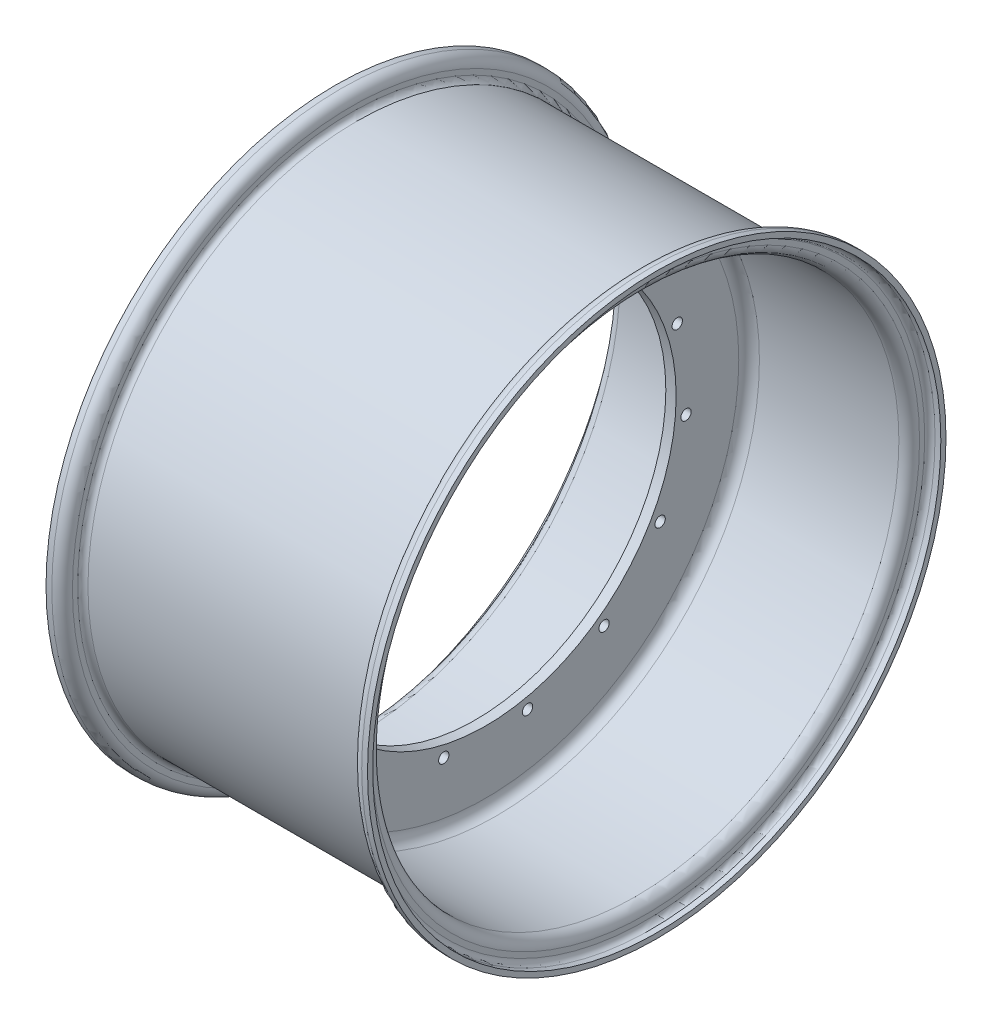
ISO-10303-21;
HEADER;
FILE_DESCRIPTION(('STEP AP214'),'2;1');
FILE_NAME('part.step','',(''),(''),'','','');
FILE_SCHEMA(('AUTOMOTIVE_DESIGN { 1 0 10303 214 1 1 1 1 }'));
ENDSEC;
DATA;
#1=APPLICATION_CONTEXT('core data for automotive mechanical design processes');
#2=APPLICATION_PROTOCOL_DEFINITION('international standard','automotive_design',2000,#1);
#3=PRODUCT_CONTEXT('',#1,'mechanical');
#4=PRODUCT('Part','Part','',(#3));
#5=PRODUCT_RELATED_PRODUCT_CATEGORY('part','',(#4));
#6=PRODUCT_DEFINITION_FORMATION('','',#4);
#7=PRODUCT_DEFINITION_CONTEXT('part definition',#1,'design');
#8=PRODUCT_DEFINITION('design','',#6,#7);
#9=PRODUCT_DEFINITION_SHAPE('','',#8);
#10=(LENGTH_UNIT() NAMED_UNIT(*) SI_UNIT(.MILLI.,.METRE.));
#11=(NAMED_UNIT(*) PLANE_ANGLE_UNIT() SI_UNIT($,.RADIAN.));
#12=(NAMED_UNIT(*) SI_UNIT($,.STERADIAN.) SOLID_ANGLE_UNIT());
#13=UNCERTAINTY_MEASURE_WITH_UNIT(LENGTH_MEASURE(1.E-05),#10,'distance_accuracy_value','');
#14=(GEOMETRIC_REPRESENTATION_CONTEXT(3) GLOBAL_UNCERTAINTY_ASSIGNED_CONTEXT((#13)) GLOBAL_UNIT_ASSIGNED_CONTEXT((#10,
#11,#12)) REPRESENTATION_CONTEXT('',''));
#15=CARTESIAN_POINT('',(0.,0.,0.));
#16=DIRECTION('',(0.,0.,1.));
#17=DIRECTION('',(1.,0.,0.));
#18=AXIS2_PLACEMENT_3D('',#15,#16,#17);
#19=CARTESIAN_POINT('',(104.775,0.,0.));
#20=DIRECTION('',(-1.,0.,0.));
#21=DIRECTION('',(0.,0.,-1.));
#22=AXIS2_PLACEMENT_3D('',#19,#20,#21);
#23=TOROIDAL_SURFACE('',#22,171.45,3.17499999999999);
#24=CARTESIAN_POINT('',(104.775,0.,0.));
#25=DIRECTION('',(1.,0.,0.));
#26=DIRECTION('',(0.,0.,-1.));
#27=AXIS2_PLACEMENT_3D('',#24,#25,#26);
#28=CIRCLE('',#27,174.625);
#29=CARTESIAN_POINT('',(104.775,0.,-174.625));
#30=VERTEX_POINT('',#29);
#31=EDGE_CURVE('E113',#30,#30,#28,.T.);
#32=ORIENTED_EDGE('',*,*,#31,.T.);
#33=EDGE_LOOP('',(#32));
#34=FACE_BOUND('',#33,.T.);
#35=CARTESIAN_POINT('',(101.6,0.,0.));
#36=DIRECTION('',(1.,0.,0.));
#37=DIRECTION('',(0.,0.,-1.));
#38=AXIS2_PLACEMENT_3D('',#35,#36,#37);
#39=CIRCLE('',#38,171.45);
#40=CARTESIAN_POINT('',(101.6,0.,-171.45));
#41=VERTEX_POINT('',#40);
#42=EDGE_CURVE('E50',#41,#41,#39,.T.);
#43=ORIENTED_EDGE('',*,*,#42,.F.);
#44=EDGE_LOOP('',(#43));
#45=FACE_BOUND('',#44,.T.);
#46=ADVANCED_FACE('F30',(#34,#45),#23,.F.);
#47=CARTESIAN_POINT('',(101.6,168.275,0.));
#48=DIRECTION('',(-1.,0.,0.));
#49=DIRECTION('',(0.,0.,-1.));
#50=AXIS2_PLACEMENT_3D('',#47,#48,#49);
#51=PLANE('',#50);
#52=ORIENTED_EDGE('',*,*,#42,.T.);
#53=EDGE_LOOP('',(#52));
#54=FACE_BOUND('',#53,.T.);
#55=CARTESIAN_POINT('',(101.6,0.,0.));
#56=DIRECTION('',(1.,0.,0.));
#57=DIRECTION('',(0.,0.,-1.));
#58=AXIS2_PLACEMENT_3D('',#55,#56,#57);
#59=CIRCLE('',#58,168.275);
#60=CARTESIAN_POINT('',(101.6,0.,-168.275));
#61=VERTEX_POINT('',#60);
#62=EDGE_CURVE('E53',#61,#61,#59,.T.);
#63=ORIENTED_EDGE('',*,*,#62,.F.);
#64=EDGE_LOOP('',(#63));
#65=FACE_BOUND('',#64,.T.);
#66=ADVANCED_FACE('F272',(#54,#65),#51,.F.);
#67=CARTESIAN_POINT('',(95.25,0.,0.));
#68=DIRECTION('',(-1.,0.,0.));
#69=DIRECTION('',(0.,0.,-1.));
#70=AXIS2_PLACEMENT_3D('',#67,#68,#69);
#71=TOROIDAL_SURFACE('',#70,168.275,6.35);
#72=ORIENTED_EDGE('',*,*,#62,.T.);
#73=EDGE_LOOP('',(#72));
#74=FACE_BOUND('',#73,.T.);
#75=CARTESIAN_POINT('',(95.25,0.,0.));
#76=DIRECTION('',(1.,0.,0.));
#77=DIRECTION('',(0.,0.,-1.));
#78=AXIS2_PLACEMENT_3D('',#75,#76,#77);
#79=CIRCLE('',#78,161.925);
#80=CARTESIAN_POINT('',(95.25,0.,-161.925));
#81=VERTEX_POINT('',#80);
#82=EDGE_CURVE('E56',#81,#81,#79,.T.);
#83=ORIENTED_EDGE('',*,*,#82,.F.);
#84=EDGE_LOOP('',(#83));
#85=FACE_BOUND('',#84,.T.);
#86=ADVANCED_FACE('F278',(#74,#85),#71,.T.);
#87=CARTESIAN_POINT('',(-87.0379104783021,0.,0.));
#88=DIRECTION('',(-1.,0.,0.));
#89=DIRECTION('',(0.,0.,-1.));
#90=AXIS2_PLACEMENT_3D('',#87,#88,#89);
#91=CYLINDRICAL_SURFACE('',#90,161.925);
#92=CARTESIAN_POINT('',(9.52500000000001,0.,0.));
#93=DIRECTION('',(1.,0.,0.));
#94=DIRECTION('',(0.,0.,-1.));
#95=AXIS2_PLACEMENT_3D('',#92,#93,#94);
#96=CIRCLE('',#95,161.925);
#97=CARTESIAN_POINT('',(9.52500000000001,0.,-161.925));
#98=VERTEX_POINT('',#97);
#99=EDGE_CURVE('E37',#98,#98,#96,.T.);
#100=ORIENTED_EDGE('',*,*,#99,.F.);
#101=EDGE_LOOP('',(#100));
#102=FACE_BOUND('',#101,.T.);
#103=ORIENTED_EDGE('',*,*,#82,.T.);
#104=EDGE_LOOP('',(#103));
#105=FACE_BOUND('',#104,.T.);
#106=ADVANCED_FACE('F222',(#102,#105),#91,.F.);
#107=CARTESIAN_POINT('',(3.17500000000001,117.094,0.));
#108=DIRECTION('',(-1.,0.,0.));
#109=DIRECTION('',(0.,0.,-1.));
#110=AXIS2_PLACEMENT_3D('',#107,#108,#109);
#111=PLANE('',#110);
#112=CARTESIAN_POINT('',(3.17500000000001,0.,0.));
#113=DIRECTION('',(1.,0.,0.));
#114=DIRECTION('',(0.,0.,-1.));
#115=AXIS2_PLACEMENT_3D('',#112,#113,#114);
#116=CIRCLE('',#115,155.575);
#117=CARTESIAN_POINT('',(3.17500000000001,0.,-155.575));
#118=VERTEX_POINT('',#117);
#119=EDGE_CURVE('E10',#118,#118,#116,.F.);
#120=ORIENTED_EDGE('',*,*,#119,.F.);
#121=EDGE_LOOP('',(#120));
#122=FACE_BOUND('',#121,.T.);
#123=CARTESIAN_POINT('',(3.17500000000001,113.119766292596,-50.3641648288596));
#124=DIRECTION('',(1.,0.,0.));
#125=DIRECTION('',(0.,0.,-1.));
#126=AXIS2_PLACEMENT_3D('',#123,#124,#125);
#127=CIRCLE('',#126,3.175);
#128=CARTESIAN_POINT('',(3.17500000000001,113.119766292596,-53.5391648288595));
#129=VERTEX_POINT('',#128);
#130=EDGE_CURVE('E200',#129,#129,#127,.T.);
#131=ORIENTED_EDGE('',*,*,#130,.F.);
#132=EDGE_LOOP('',(#131));
#133=FACE_BOUND('',#132,.T.);
#134=CARTESIAN_POINT('',(3.17500000000001,82.8550973323867,-92.0199080147374));
#135=DIRECTION('',(1.,0.,0.));
#136=DIRECTION('',(0.,0.,-1.));
#137=AXIS2_PLACEMENT_3D('',#134,#135,#136);
#138=CIRCLE('',#137,3.175);
#139=CARTESIAN_POINT('',(3.17500000000001,82.8550973323867,-95.1949080147374));
#140=VERTEX_POINT('',#139);
#141=EDGE_CURVE('E194',#140,#140,#138,.T.);
#142=ORIENTED_EDGE('',*,*,#141,.F.);
#143=EDGE_LOOP('',(#142));
#144=FACE_BOUND('',#143,.T.);
#145=CARTESIAN_POINT('',(3.17500000000001,38.2640293284791,-117.764573130247));
#146=DIRECTION('',(1.,0.,0.));
#147=DIRECTION('',(0.,0.,-1.));
#148=AXIS2_PLACEMENT_3D('',#145,#146,#147);
#149=CIRCLE('',#148,3.175);
#150=CARTESIAN_POINT('',(3.17500000000001,38.2640293284791,-120.939573130247));
#151=VERTEX_POINT('',#150);
#152=EDGE_CURVE('E188',#151,#151,#149,.T.);
#153=ORIENTED_EDGE('',*,*,#152,.F.);
#154=EDGE_LOOP('',(#153));
#155=FACE_BOUND('',#154,.T.);
#156=CARTESIAN_POINT('',(3.17500000000001,-12.943236964116,-123.146673693977));
#157=DIRECTION('',(1.,0.,0.));
#158=DIRECTION('',(0.,0.,-1.));
#159=AXIS2_PLACEMENT_3D('',#156,#157,#158);
#160=CIRCLE('',#159,3.175);
#161=CARTESIAN_POINT('',(3.17500000000001,-12.943236964116,-126.321673693977));
#162=VERTEX_POINT('',#161);
#163=EDGE_CURVE('E182',#162,#162,#160,.T.);
#164=ORIENTED_EDGE('',*,*,#163,.F.);
#165=EDGE_LOOP('',(#164));
#166=FACE_BOUND('',#165,.T.);
#167=CARTESIAN_POINT('',(3.17500000000001,-61.912499999999,-107.235595623609));
#168=DIRECTION('',(1.,0.,0.));
#169=DIRECTION('',(0.,0.,-1.));
#170=AXIS2_PLACEMENT_3D('',#167,#168,#169);
#171=CIRCLE('',#170,3.175);
#172=CARTESIAN_POINT('',(3.17500000000001,-61.912499999999,-110.410595623609));
#173=VERTEX_POINT('',#172);
#174=EDGE_CURVE('E176',#173,#173,#171,.T.);
#175=ORIENTED_EDGE('',*,*,#174,.F.);
#176=EDGE_LOOP('',(#175));
#177=FACE_BOUND('',#176,.T.);
#178=CARTESIAN_POINT('',(3.17500000000001,-100.176529328477,-72.7825088651163));
#179=DIRECTION('',(1.,0.,0.));
#180=DIRECTION('',(0.,0.,-1.));
#181=AXIS2_PLACEMENT_3D('',#178,#179,#180);
#182=CIRCLE('',#181,3.175);
#183=CARTESIAN_POINT('',(3.17500000000001,-100.176529328477,-75.9575088651163));
#184=VERTEX_POINT('',#183);
#185=EDGE_CURVE('E170',#184,#184,#182,.T.);
#186=ORIENTED_EDGE('',*,*,#185,.F.);
#187=EDGE_LOOP('',(#186));
#188=FACE_BOUND('',#187,.T.);
#189=CARTESIAN_POINT('',(3.17500000000001,-121.119126660863,-25.7446651155099));
#190=DIRECTION('',(1.,0.,0.));
#191=DIRECTION('',(0.,0.,-1.));
#192=AXIS2_PLACEMENT_3D('',#189,#190,#191);
#193=CIRCLE('',#192,3.175);
#194=CARTESIAN_POINT('',(3.17500000000001,-121.119126660863,-28.9196651155099));
#195=VERTEX_POINT('',#194);
#196=EDGE_CURVE('E164',#195,#195,#193,.T.);
#197=ORIENTED_EDGE('',*,*,#196,.F.);
#198=EDGE_LOOP('',(#197));
#199=FACE_BOUND('',#198,.T.);
#200=CARTESIAN_POINT('',(3.17500000000001,-121.119126660864,25.7446651155083));
#201=DIRECTION('',(1.,0.,0.));
#202=DIRECTION('',(0.,0.,-1.));
#203=AXIS2_PLACEMENT_3D('',#200,#201,#202);
#204=CIRCLE('',#203,3.175);
#205=CARTESIAN_POINT('',(3.17500000000001,-121.119126660864,22.5696651155083));
#206=VERTEX_POINT('',#205);
#207=EDGE_CURVE('E158',#206,#206,#204,.T.);
#208=ORIENTED_EDGE('',*,*,#207,.F.);
#209=EDGE_LOOP('',(#208));
#210=FACE_BOUND('',#209,.T.);
#211=CARTESIAN_POINT('',(3.17500000000001,-100.176529328478,72.782508865115));
#212=DIRECTION('',(1.,0.,0.));
#213=DIRECTION('',(0.,0.,-1.));
#214=AXIS2_PLACEMENT_3D('',#211,#212,#213);
#215=CIRCLE('',#214,3.175);
#216=CARTESIAN_POINT('',(3.17500000000001,-100.176529328478,69.607508865115));
#217=VERTEX_POINT('',#216);
#218=EDGE_CURVE('E152',#217,#217,#215,.T.);
#219=ORIENTED_EDGE('',*,*,#218,.F.);
#220=EDGE_LOOP('',(#219));
#221=FACE_BOUND('',#220,.T.);
#222=CARTESIAN_POINT('',(3.17500000000001,-61.9125000000005,107.235595623608));
#223=DIRECTION('',(1.,0.,0.));
#224=DIRECTION('',(0.,0.,-1.));
#225=AXIS2_PLACEMENT_3D('',#222,#223,#224);
#226=CIRCLE('',#225,3.175);
#227=CARTESIAN_POINT('',(3.17500000000001,-61.9125000000005,104.060595623608));
#228=VERTEX_POINT('',#227);
#229=EDGE_CURVE('E146',#228,#228,#226,.T.);
#230=ORIENTED_EDGE('',*,*,#229,.F.);
#231=EDGE_LOOP('',(#230));
#232=FACE_BOUND('',#231,.T.);
#233=CARTESIAN_POINT('',(3.17500000000001,-12.9432369641176,123.146673693976));
#234=DIRECTION('',(1.,0.,0.));
#235=DIRECTION('',(0.,0.,-1.));
#236=AXIS2_PLACEMENT_3D('',#233,#234,#235);
#237=CIRCLE('',#236,3.175);
#238=CARTESIAN_POINT('',(3.17500000000001,-12.9432369641176,119.971673693976));
#239=VERTEX_POINT('',#238);
#240=EDGE_CURVE('E140',#239,#239,#237,.T.);
#241=ORIENTED_EDGE('',*,*,#240,.F.);
#242=EDGE_LOOP('',(#241));
#243=FACE_BOUND('',#242,.T.);
#244=CARTESIAN_POINT('',(3.17500000000001,38.2640293284776,117.764573130247));
#245=DIRECTION('',(1.,0.,0.));
#246=DIRECTION('',(0.,0.,-1.));
#247=AXIS2_PLACEMENT_3D('',#244,#245,#246);
#248=CIRCLE('',#247,3.175);
#249=CARTESIAN_POINT('',(3.17500000000001,38.2640293284776,114.589573130247));
#250=VERTEX_POINT('',#249);
#251=EDGE_CURVE('E134',#250,#250,#248,.T.);
#252=ORIENTED_EDGE('',*,*,#251,.F.);
#253=EDGE_LOOP('',(#252));
#254=FACE_BOUND('',#253,.T.);
#255=CARTESIAN_POINT('',(3.17500000000001,82.8550973323855,92.0199080147385));
#256=DIRECTION('',(1.,0.,0.));
#257=DIRECTION('',(0.,0.,-1.));
#258=AXIS2_PLACEMENT_3D('',#255,#256,#257);
#259=CIRCLE('',#258,3.175);
#260=CARTESIAN_POINT('',(3.17500000000001,82.8550973323855,88.8449080147385));
#261=VERTEX_POINT('',#260);
#262=EDGE_CURVE('E128',#261,#261,#259,.T.);
#263=ORIENTED_EDGE('',*,*,#262,.F.);
#264=EDGE_LOOP('',(#263));
#265=FACE_BOUND('',#264,.T.);
#266=CARTESIAN_POINT('',(3.17500000000001,113.119766292595,50.3641648288611));
#267=DIRECTION('',(1.,0.,0.));
#268=DIRECTION('',(0.,0.,-1.));
#269=AXIS2_PLACEMENT_3D('',#266,#267,#268);
#270=CIRCLE('',#269,3.175);
#271=CARTESIAN_POINT('',(3.17500000000001,113.119766292595,47.1891648288611));
#272=VERTEX_POINT('',#271);
#273=EDGE_CURVE('E122',#272,#272,#270,.T.);
#274=ORIENTED_EDGE('',*,*,#273,.F.);
#275=EDGE_LOOP('',(#274));
#276=FACE_BOUND('',#275,.T.);
#277=CARTESIAN_POINT('',(3.17500000000001,123.825,0.));
#278=DIRECTION('',(1.,0.,0.));
#279=DIRECTION('',(0.,0.,-1.));
#280=AXIS2_PLACEMENT_3D('',#277,#278,#279);
#281=CIRCLE('',#280,3.175);
#282=CARTESIAN_POINT('',(3.17500000000001,123.825,-3.175));
#283=VERTEX_POINT('',#282);
#284=EDGE_CURVE('E116',#283,#283,#281,.T.);
#285=ORIENTED_EDGE('',*,*,#284,.F.);
#286=EDGE_LOOP('',(#285));
#287=FACE_BOUND('',#286,.T.);
#288=CARTESIAN_POINT('',(3.17500000000001,0.,0.));
#289=DIRECTION('',(1.,0.,0.));
#290=DIRECTION('',(0.,0.,-1.));
#291=AXIS2_PLACEMENT_3D('',#288,#289,#290);
#292=CIRCLE('',#291,117.094);
#293=CARTESIAN_POINT('',(3.17500000000001,0.,-117.094));
#294=VERTEX_POINT('',#293);
#295=EDGE_CURVE('E59',#294,#294,#292,.T.);
#296=ORIENTED_EDGE('',*,*,#295,.F.);
#297=EDGE_LOOP('',(#296));
#298=FACE_BOUND('',#297,.T.);
#299=ADVANCED_FACE('F218',(#122,#133,#144,#155,#166,#177,#188,#199,#210,#221,#232,#243,#254,
#265,#276,#287,#298),#111,.F.);
#300=CARTESIAN_POINT('',(-87.0379104783021,0.,0.));
#301=DIRECTION('',(-1.,0.,0.));
#302=DIRECTION('',(0.,0.,-1.));
#303=AXIS2_PLACEMENT_3D('',#300,#301,#302);
#304=CYLINDRICAL_SURFACE('',#303,117.094);
#305=ORIENTED_EDGE('',*,*,#295,.T.);
#306=EDGE_LOOP('',(#305));
#307=FACE_BOUND('',#306,.T.);
#308=CARTESIAN_POINT('',(-3.175,0.,0.));
#309=DIRECTION('',(1.,0.,0.));
#310=DIRECTION('',(0.,0.,-1.));
#311=AXIS2_PLACEMENT_3D('',#308,#309,#310);
#312=CIRCLE('',#311,117.094);
#313=CARTESIAN_POINT('',(-3.175,0.,-117.094));
#314=VERTEX_POINT('',#313);
#315=EDGE_CURVE('E62',#314,#314,#312,.T.);
#316=ORIENTED_EDGE('',*,*,#315,.F.);
#317=EDGE_LOOP('',(#316));
#318=FACE_BOUND('',#317,.T.);
#319=ADVANCED_FACE('F221',(#307,#318),#304,.F.);
#320=CARTESIAN_POINT('',(-3.175,161.925,0.));
#321=DIRECTION('',(1.,0.,0.));
#322=DIRECTION('',(0.,0.,1.));
#323=AXIS2_PLACEMENT_3D('',#320,#321,#322);
#324=PLANE('',#323);
#325=CARTESIAN_POINT('',(-3.175,0.,0.));
#326=DIRECTION('',(-1.,0.,0.));
#327=DIRECTION('',(0.,0.,1.));
#328=AXIS2_PLACEMENT_3D('',#325,#326,#327);
#329=CIRCLE('',#328,155.575);
#330=CARTESIAN_POINT('',(-3.175,0.,155.575));
#331=VERTEX_POINT('',#330);
#332=EDGE_CURVE('E45',#331,#331,#329,.F.);
#333=ORIENTED_EDGE('',*,*,#332,.F.);
#334=EDGE_LOOP('',(#333));
#335=FACE_BOUND('',#334,.T.);
#336=CARTESIAN_POINT('',(-3.175,113.119766292596,-50.3641648288596));
#337=DIRECTION('',(1.,0.,0.));
#338=DIRECTION('',(0.,-0.406736643075789,-0.913545457642606));
#339=AXIS2_PLACEMENT_3D('',#336,#337,#338);
#340=CIRCLE('',#339,3.175);
#341=CARTESIAN_POINT('',(-3.175,111.82837745083,-53.2646716568748));
#342=VERTEX_POINT('',#341);
#343=EDGE_CURVE('E203',#342,#342,#340,.T.);
#344=ORIENTED_EDGE('',*,*,#343,.T.);
#345=EDGE_LOOP('',(#344));
#346=FACE_BOUND('',#345,.T.);
#347=CARTESIAN_POINT('',(-3.175,82.8550973323867,-92.0199080147374));
#348=DIRECTION('',(1.,0.,0.));
#349=DIRECTION('',(0.,-0.743144825477386,-0.669130606358867));
#350=AXIS2_PLACEMENT_3D('',#347,#348,#349);
#351=CIRCLE('',#350,3.175);
#352=CARTESIAN_POINT('',(-3.175,80.495612511496,-94.1443976899267));
#353=VERTEX_POINT('',#352);
#354=EDGE_CURVE('E197',#353,#353,#351,.T.);
#355=ORIENTED_EDGE('',*,*,#354,.T.);
#356=EDGE_LOOP('',(#355));
#357=FACE_BOUND('',#356,.T.);
#358=CARTESIAN_POINT('',(-3.175,38.2640293284791,-117.764573130247));
#359=DIRECTION('',(1.,0.,0.));
#360=DIRECTION('',(0.,-0.95105651629515,-0.309016994374957));
#361=AXIS2_PLACEMENT_3D('',#358,#359,#360);
#362=CIRCLE('',#361,3.175);
#363=CARTESIAN_POINT('',(-3.175,35.244424889242,-118.745702087387));
#364=VERTEX_POINT('',#363);
#365=EDGE_CURVE('E191',#364,#364,#362,.T.);
#366=ORIENTED_EDGE('',*,*,#365,.T.);
#367=EDGE_LOOP('',(#366));
#368=FACE_BOUND('',#367,.T.);
#369=CARTESIAN_POINT('',(-3.175,-12.943236964116,-123.146673693977));
#370=DIRECTION('',(1.,0.,0.));
#371=DIRECTION('',(0.,-0.994521895368274,0.104528463267644));
#372=AXIS2_PLACEMENT_3D('',#369,#370,#371);
#373=CIRCLE('',#372,3.175);
#374=CARTESIAN_POINT('',(-3.175,-16.1008439819102,-122.814795823102));
#375=VERTEX_POINT('',#374);
#376=EDGE_CURVE('E185',#375,#375,#373,.T.);
#377=ORIENTED_EDGE('',*,*,#376,.T.);
#378=EDGE_LOOP('',(#377));
#379=FACE_BOUND('',#378,.T.);
#380=CARTESIAN_POINT('',(-3.175,-61.912499999999,-107.235595623609));
#381=DIRECTION('',(1.,0.,0.));
#382=DIRECTION('',(0.,-0.866025403784443,0.499999999999992));
#383=AXIS2_PLACEMENT_3D('',#380,#381,#382);
#384=CIRCLE('',#383,3.175);
#385=CARTESIAN_POINT('',(-3.175,-64.6621306570146,-105.648095623609));
#386=VERTEX_POINT('',#385);
#387=EDGE_CURVE('E179',#386,#386,#384,.T.);
#388=ORIENTED_EDGE('',*,*,#387,.T.);
#389=EDGE_LOOP('',(#388));
#390=FACE_BOUND('',#389,.T.);
#391=CARTESIAN_POINT('',(-3.175,-100.176529328477,-72.7825088651163));
#392=DIRECTION('',(1.,0.,0.));
#393=DIRECTION('',(0.,-0.58778525229248,0.809016994374943));
#394=AXIS2_PLACEMENT_3D('',#391,#392,#393);
#395=CIRCLE('',#394,3.175);
#396=CARTESIAN_POINT('',(-3.175,-102.042747504506,-70.2138799079759));
#397=VERTEX_POINT('',#396);
#398=EDGE_CURVE('E173',#397,#397,#395,.T.);
#399=ORIENTED_EDGE('',*,*,#398,.T.);
#400=EDGE_LOOP('',(#399));
#401=FACE_BOUND('',#400,.T.);
#402=CARTESIAN_POINT('',(-3.175,-121.119126660863,-25.7446651155099));
#403=DIRECTION('',(1.,0.,0.));
#404=DIRECTION('',(0.,-0.207911690817766,0.978147600733804));
#405=AXIS2_PLACEMENT_3D('',#402,#403,#404);
#406=CIRCLE('',#405,3.175);
#407=CARTESIAN_POINT('',(-3.175,-121.77924627921,-22.6390464831801));
#408=VERTEX_POINT('',#407);
#409=EDGE_CURVE('E167',#408,#408,#406,.T.);
#410=ORIENTED_EDGE('',*,*,#409,.T.);
#411=EDGE_LOOP('',(#410));
#412=FACE_BOUND('',#411,.T.);
#413=CARTESIAN_POINT('',(-3.175,-121.119126660864,25.7446651155083));
#414=DIRECTION('',(1.,0.,0.));
#415=DIRECTION('',(0.,0.207911690817753,0.978147600733807));
#416=AXIS2_PLACEMENT_3D('',#413,#414,#415);
#417=CIRCLE('',#416,3.175);
#418=CARTESIAN_POINT('',(-3.175,-120.459007042517,28.8502837478381));
#419=VERTEX_POINT('',#418);
#420=EDGE_CURVE('E161',#419,#419,#417,.T.);
#421=ORIENTED_EDGE('',*,*,#420,.T.);
#422=EDGE_LOOP('',(#421));
#423=FACE_BOUND('',#422,.T.);
#424=CARTESIAN_POINT('',(-3.175,-100.176529328478,72.782508865115));
#425=DIRECTION('',(1.,0.,0.));
#426=DIRECTION('',(0.,0.587785252292469,0.80901699437495));
#427=AXIS2_PLACEMENT_3D('',#424,#425,#426);
#428=CIRCLE('',#427,3.175);
#429=CARTESIAN_POINT('',(-3.175,-98.3103111524496,75.3511378222554));
#430=VERTEX_POINT('',#429);
#431=EDGE_CURVE('E155',#430,#430,#428,.T.);
#432=ORIENTED_EDGE('',*,*,#431,.T.);
#433=EDGE_LOOP('',(#432));
#434=FACE_BOUND('',#433,.T.);
#435=CARTESIAN_POINT('',(-3.175,-61.9125000000005,107.235595623608));
#436=DIRECTION('',(1.,0.,0.));
#437=DIRECTION('',(0.,0.866025403784436,0.500000000000004));
#438=AXIS2_PLACEMENT_3D('',#435,#436,#437);
#439=CIRCLE('',#438,3.175);
#440=CARTESIAN_POINT('',(-3.175,-59.1628693429849,108.823095623608));
#441=VERTEX_POINT('',#440);
#442=EDGE_CURVE('E149',#441,#441,#439,.T.);
#443=ORIENTED_EDGE('',*,*,#442,.T.);
#444=EDGE_LOOP('',(#443));
#445=FACE_BOUND('',#444,.T.);
#446=CARTESIAN_POINT('',(-3.175,-12.9432369641176,123.146673693976));
#447=DIRECTION('',(1.,0.,0.));
#448=DIRECTION('',(0.,0.994521895368273,0.104528463267657));
#449=AXIS2_PLACEMENT_3D('',#446,#447,#448);
#450=CIRCLE('',#449,3.175);
#451=CARTESIAN_POINT('',(-3.175,-9.78562994632337,123.478551564851));
#452=VERTEX_POINT('',#451);
#453=EDGE_CURVE('E143',#452,#452,#450,.T.);
#454=ORIENTED_EDGE('',*,*,#453,.T.);
#455=EDGE_LOOP('',(#454));
#456=FACE_BOUND('',#455,.T.);
#457=CARTESIAN_POINT('',(-3.175,38.2640293284776,117.764573130247));
#458=DIRECTION('',(1.,0.,0.));
#459=DIRECTION('',(0.,0.951056516295154,-0.309016994374945));
#460=AXIS2_PLACEMENT_3D('',#457,#458,#459);
#461=CIRCLE('',#460,3.175);
#462=CARTESIAN_POINT('',(-3.175,41.2836337677147,116.783444173107));
#463=VERTEX_POINT('',#462);
#464=EDGE_CURVE('E137',#463,#463,#461,.T.);
#465=ORIENTED_EDGE('',*,*,#464,.T.);
#466=EDGE_LOOP('',(#465));
#467=FACE_BOUND('',#466,.T.);
#468=CARTESIAN_POINT('',(-3.175,82.8550973323855,92.0199080147385));
#469=DIRECTION('',(1.,0.,0.));
#470=DIRECTION('',(0.,0.743144825477395,-0.669130606358857));
#471=AXIS2_PLACEMENT_3D('',#468,#469,#470);
#472=CIRCLE('',#471,3.175);
#473=CARTESIAN_POINT('',(-3.175,85.2145821532762,89.8954183395491));
#474=VERTEX_POINT('',#473);
#475=EDGE_CURVE('E131',#474,#474,#472,.T.);
#476=ORIENTED_EDGE('',*,*,#475,.T.);
#477=EDGE_LOOP('',(#476));
#478=FACE_BOUND('',#477,.T.);
#479=CARTESIAN_POINT('',(-3.175,113.119766292595,50.3641648288611));
#480=DIRECTION('',(1.,0.,0.));
#481=DIRECTION('',(0.,0.406736643075801,-0.913545457642601));
#482=AXIS2_PLACEMENT_3D('',#479,#480,#481);
#483=CIRCLE('',#482,3.175);
#484=CARTESIAN_POINT('',(-3.175,114.411155134361,47.4636580008458));
#485=VERTEX_POINT('',#484);
#486=EDGE_CURVE('E125',#485,#485,#483,.T.);
#487=ORIENTED_EDGE('',*,*,#486,.T.);
#488=EDGE_LOOP('',(#487));
#489=FACE_BOUND('',#488,.T.);
#490=CARTESIAN_POINT('',(-3.175,123.825,0.));
#491=DIRECTION('',(1.,0.,0.));
#492=DIRECTION('',(0.,0.,-1.));
#493=AXIS2_PLACEMENT_3D('',#490,#491,#492);
#494=CIRCLE('',#493,3.175);
#495=CARTESIAN_POINT('',(-3.175,123.825,-3.175));
#496=VERTEX_POINT('',#495);
#497=EDGE_CURVE('E119',#496,#496,#494,.T.);
#498=ORIENTED_EDGE('',*,*,#497,.T.);
#499=EDGE_LOOP('',(#498));
#500=FACE_BOUND('',#499,.T.);
#501=ORIENTED_EDGE('',*,*,#315,.T.);
#502=EDGE_LOOP('',(#501));
#503=FACE_BOUND('',#502,.T.);
#504=ADVANCED_FACE('F207',(#335,#346,#357,#368,#379,#390,#401,#412,#423,#434,#445,#456,#467,
#478,#489,#500,#503),#324,.F.);
#505=CARTESIAN_POINT('',(-87.0379104783021,0.,0.));
#506=DIRECTION('',(-1.,0.,0.));
#507=DIRECTION('',(0.,0.,-1.));
#508=AXIS2_PLACEMENT_3D('',#505,#506,#507);
#509=CYLINDRICAL_SURFACE('',#508,161.925);
#510=CARTESIAN_POINT('',(-9.52500000000001,0.,0.));
#511=DIRECTION('',(-1.,0.,0.));
#512=DIRECTION('',(0.,0.,1.));
#513=AXIS2_PLACEMENT_3D('',#510,#511,#512);
#514=CIRCLE('',#513,161.925);
#515=CARTESIAN_POINT('',(-9.52500000000001,0.,161.925));
#516=VERTEX_POINT('',#515);
#517=EDGE_CURVE('E41',#516,#516,#514,.T.);
#518=ORIENTED_EDGE('',*,*,#517,.F.);
#519=EDGE_LOOP('',(#518));
#520=FACE_BOUND('',#519,.T.);
#521=CARTESIAN_POINT('',(-76.2,0.,0.));
#522=DIRECTION('',(1.,0.,0.));
#523=DIRECTION('',(0.,0.,-1.));
#524=AXIS2_PLACEMENT_3D('',#521,#522,#523);
#525=CIRCLE('',#524,161.925);
#526=CARTESIAN_POINT('',(-76.2,0.,-161.925));
#527=VERTEX_POINT('',#526);
#528=EDGE_CURVE('E65',#527,#527,#525,.T.);
#529=ORIENTED_EDGE('',*,*,#528,.F.);
#530=EDGE_LOOP('',(#529));
#531=FACE_BOUND('',#530,.T.);
#532=ADVANCED_FACE('F261',(#520,#531),#509,.F.);
#533=CARTESIAN_POINT('',(-76.2,0.,0.));
#534=DIRECTION('',(-1.,0.,0.));
#535=DIRECTION('',(0.,0.,-1.));
#536=AXIS2_PLACEMENT_3D('',#533,#534,#535);
#537=TOROIDAL_SURFACE('',#536,168.275,6.35000000000002);
#538=ORIENTED_EDGE('',*,*,#528,.T.);
#539=EDGE_LOOP('',(#538));
#540=FACE_BOUND('',#539,.T.);
#541=CARTESIAN_POINT('',(-82.55,0.,0.));
#542=DIRECTION('',(1.,0.,0.));
#543=DIRECTION('',(0.,0.,-1.));
#544=AXIS2_PLACEMENT_3D('',#541,#542,#543);
#545=CIRCLE('',#544,168.275);
#546=CARTESIAN_POINT('',(-82.55,0.,-168.275));
#547=VERTEX_POINT('',#546);
#548=EDGE_CURVE('E68',#547,#547,#545,.T.);
#549=ORIENTED_EDGE('',*,*,#548,.F.);
#550=EDGE_LOOP('',(#549));
#551=FACE_BOUND('',#550,.T.);
#552=ADVANCED_FACE('F267',(#540,#551),#537,.T.);
#553=CARTESIAN_POINT('',(-82.55,168.275,0.));
#554=DIRECTION('',(1.,0.,0.));
#555=DIRECTION('',(0.,0.,1.));
#556=AXIS2_PLACEMENT_3D('',#553,#554,#555);
#557=PLANE('',#556);
#558=ORIENTED_EDGE('',*,*,#548,.T.);
#559=EDGE_LOOP('',(#558));
#560=FACE_BOUND('',#559,.T.);
#561=CARTESIAN_POINT('',(-82.55,0.,0.));
#562=DIRECTION('',(1.,0.,0.));
#563=DIRECTION('',(0.,0.,-1.));
#564=AXIS2_PLACEMENT_3D('',#561,#562,#563);
#565=CIRCLE('',#564,171.45);
#566=CARTESIAN_POINT('',(-82.55,0.,-171.45));
#567=VERTEX_POINT('',#566);
#568=EDGE_CURVE('E71',#567,#567,#565,.T.);
#569=ORIENTED_EDGE('',*,*,#568,.F.);
#570=EDGE_LOOP('',(#569));
#571=FACE_BOUND('',#570,.T.);
#572=ADVANCED_FACE('F295',(#560,#571),#557,.F.);
#573=CARTESIAN_POINT('',(-85.725,0.,0.));
#574=DIRECTION('',(-1.,0.,0.));
#575=DIRECTION('',(0.,0.,-1.));
#576=AXIS2_PLACEMENT_3D('',#573,#574,#575);
#577=TOROIDAL_SURFACE('',#576,171.45,3.17499999999999);
#578=ORIENTED_EDGE('',*,*,#568,.T.);
#579=EDGE_LOOP('',(#578));
#580=FACE_BOUND('',#579,.T.);
#581=CARTESIAN_POINT('',(-85.725,0.,0.));
#582=DIRECTION('',(1.,0.,0.));
#583=DIRECTION('',(0.,0.,-1.));
#584=AXIS2_PLACEMENT_3D('',#581,#582,#583);
#585=CIRCLE('',#584,174.625);
#586=CARTESIAN_POINT('',(-85.725,0.,-174.625));
#587=VERTEX_POINT('',#586);
#588=EDGE_CURVE('E74',#587,#587,#585,.T.);
#589=ORIENTED_EDGE('',*,*,#588,.F.);
#590=EDGE_LOOP('',(#589));
#591=FACE_BOUND('',#590,.T.);
#592=ADVANCED_FACE('F301',(#580,#591),#577,.F.);
#593=CARTESIAN_POINT('',(-87.0379104783021,0.,0.));
#594=DIRECTION('',(-1.,0.,0.));
#595=DIRECTION('',(0.,0.,-1.));
#596=AXIS2_PLACEMENT_3D('',#593,#594,#595);
#597=CYLINDRICAL_SURFACE('',#596,174.625);
#598=ORIENTED_EDGE('',*,*,#588,.T.);
#599=EDGE_LOOP('',(#598));
#600=FACE_BOUND('',#599,.T.);
#601=CARTESIAN_POINT('',(-89.281,0.,0.));
#602=DIRECTION('',(1.,0.,0.));
#603=DIRECTION('',(0.,0.,-1.));
#604=AXIS2_PLACEMENT_3D('',#601,#602,#603);
#605=CIRCLE('',#604,174.625);
#606=CARTESIAN_POINT('',(-89.281,0.,-174.625));
#607=VERTEX_POINT('',#606);
#608=EDGE_CURVE('E77',#607,#607,#605,.T.);
#609=ORIENTED_EDGE('',*,*,#608,.F.);
#610=EDGE_LOOP('',(#609));
#611=FACE_BOUND('',#610,.T.);
#612=ADVANCED_FACE('F307',(#600,#611),#597,.F.);
#613=CARTESIAN_POINT('',(-89.281,177.8,0.));
#614=DIRECTION('',(1.,0.,0.));
#615=DIRECTION('',(0.,0.,1.));
#616=AXIS2_PLACEMENT_3D('',#613,#614,#615);
#617=PLANE('',#616);
#618=ORIENTED_EDGE('',*,*,#608,.T.);
#619=EDGE_LOOP('',(#618));
#620=FACE_BOUND('',#619,.T.);
#621=CARTESIAN_POINT('',(-89.281,0.,0.));
#622=DIRECTION('',(1.,0.,0.));
#623=DIRECTION('',(0.,0.,-1.));
#624=AXIS2_PLACEMENT_3D('',#621,#622,#623);
#625=CIRCLE('',#624,177.8);
#626=CARTESIAN_POINT('',(-89.281,0.,-177.8));
#627=VERTEX_POINT('',#626);
#628=EDGE_CURVE('E80',#627,#627,#625,.T.);
#629=ORIENTED_EDGE('',*,*,#628,.F.);
#630=EDGE_LOOP('',(#629));
#631=FACE_BOUND('',#630,.T.);
#632=ADVANCED_FACE('F313',(#620,#631),#617,.F.);
#633=CARTESIAN_POINT('',(-87.0379104783021,0.,0.));
#634=DIRECTION('',(-1.,0.,0.));
#635=DIRECTION('',(0.,0.,-1.));
#636=AXIS2_PLACEMENT_3D('',#633,#634,#635);
#637=CYLINDRICAL_SURFACE('',#636,177.8);
#638=ORIENTED_EDGE('',*,*,#628,.T.);
#639=EDGE_LOOP('',(#638));
#640=FACE_BOUND('',#639,.T.);
#641=CARTESIAN_POINT('',(-85.725,0.,0.));
#642=DIRECTION('',(1.,0.,0.));
#643=DIRECTION('',(0.,0.,-1.));
#644=AXIS2_PLACEMENT_3D('',#641,#642,#643);
#645=CIRCLE('',#644,177.8);
#646=CARTESIAN_POINT('',(-85.725,0.,-177.8));
#647=VERTEX_POINT('',#646);
#648=EDGE_CURVE('E83',#647,#647,#645,.T.);
#649=ORIENTED_EDGE('',*,*,#648,.F.);
#650=EDGE_LOOP('',(#649));
#651=FACE_BOUND('',#650,.T.);
#652=ADVANCED_FACE('F319',(#640,#651),#637,.T.);
#653=CARTESIAN_POINT('',(-85.725,0.,0.));
#654=DIRECTION('',(-1.,0.,0.));
#655=DIRECTION('',(0.,0.,-1.));
#656=AXIS2_PLACEMENT_3D('',#653,#654,#655);
#657=TOROIDAL_SURFACE('',#656,171.45,6.34999999999999);
#658=ORIENTED_EDGE('',*,*,#648,.T.);
#659=EDGE_LOOP('',(#658));
#660=FACE_BOUND('',#659,.T.);
#661=CARTESIAN_POINT('',(-79.375,0.,0.));
#662=DIRECTION('',(1.,0.,0.));
#663=DIRECTION('',(0.,0.,-1.));
#664=AXIS2_PLACEMENT_3D('',#661,#662,#663);
#665=CIRCLE('',#664,171.45);
#666=CARTESIAN_POINT('',(-79.375,0.,-171.45));
#667=VERTEX_POINT('',#666);
#668=EDGE_CURVE('E86',#667,#667,#665,.T.);
#669=ORIENTED_EDGE('',*,*,#668,.F.);
#670=EDGE_LOOP('',(#669));
#671=FACE_BOUND('',#670,.T.);
#672=ADVANCED_FACE('F325',(#660,#671),#657,.T.);
#673=CARTESIAN_POINT('',(-79.375,168.275,0.));
#674=DIRECTION('',(-1.,0.,0.));
#675=DIRECTION('',(0.,0.,-1.));
#676=AXIS2_PLACEMENT_3D('',#673,#674,#675);
#677=PLANE('',#676);
#678=ORIENTED_EDGE('',*,*,#668,.T.);
#679=EDGE_LOOP('',(#678));
#680=FACE_BOUND('',#679,.T.);
#681=CARTESIAN_POINT('',(-79.375,0.,0.));
#682=DIRECTION('',(1.,0.,0.));
#683=DIRECTION('',(0.,0.,-1.));
#684=AXIS2_PLACEMENT_3D('',#681,#682,#683);
#685=CIRCLE('',#684,168.275);
#686=CARTESIAN_POINT('',(-79.375,0.,-168.275));
#687=VERTEX_POINT('',#686);
#688=EDGE_CURVE('E89',#687,#687,#685,.T.);
#689=ORIENTED_EDGE('',*,*,#688,.F.);
#690=EDGE_LOOP('',(#689));
#691=FACE_BOUND('',#690,.T.);
#692=ADVANCED_FACE('F331',(#680,#691),#677,.F.);
#693=CARTESIAN_POINT('',(-76.2,0.,0.));
#694=DIRECTION('',(-1.,0.,0.));
#695=DIRECTION('',(0.,0.,-1.));
#696=AXIS2_PLACEMENT_3D('',#693,#694,#695);
#697=TOROIDAL_SURFACE('',#696,168.275,3.17500000000001);
#698=ORIENTED_EDGE('',*,*,#688,.T.);
#699=EDGE_LOOP('',(#698));
#700=FACE_BOUND('',#699,.T.);
#701=CARTESIAN_POINT('',(-76.2,0.,0.));
#702=DIRECTION('',(1.,0.,0.));
#703=DIRECTION('',(0.,0.,-1.));
#704=AXIS2_PLACEMENT_3D('',#701,#702,#703);
#705=CIRCLE('',#704,165.1);
#706=CARTESIAN_POINT('',(-76.2,0.,-165.1));
#707=VERTEX_POINT('',#706);
#708=EDGE_CURVE('E92',#707,#707,#705,.T.);
#709=ORIENTED_EDGE('',*,*,#708,.F.);
#710=EDGE_LOOP('',(#709));
#711=FACE_BOUND('',#710,.T.);
#712=ADVANCED_FACE('F337',(#700,#711),#697,.F.);
#713=CARTESIAN_POINT('',(-87.0379104783021,0.,0.));
#714=DIRECTION('',(-1.,0.,0.));
#715=DIRECTION('',(0.,0.,-1.));
#716=AXIS2_PLACEMENT_3D('',#713,#714,#715);
#717=CYLINDRICAL_SURFACE('',#716,165.1);
#718=ORIENTED_EDGE('',*,*,#708,.T.);
#719=EDGE_LOOP('',(#718));
#720=FACE_BOUND('',#719,.T.);
#721=CARTESIAN_POINT('',(95.25,0.,0.));
#722=DIRECTION('',(1.,0.,0.));
#723=DIRECTION('',(0.,0.,-1.));
#724=AXIS2_PLACEMENT_3D('',#721,#722,#723);
#725=CIRCLE('',#724,165.1);
#726=CARTESIAN_POINT('',(95.25,0.,-165.1));
#727=VERTEX_POINT('',#726);
#728=EDGE_CURVE('E95',#727,#727,#725,.T.);
#729=ORIENTED_EDGE('',*,*,#728,.F.);
#730=EDGE_LOOP('',(#729));
#731=FACE_BOUND('',#730,.T.);
#732=ADVANCED_FACE('F343',(#720,#731),#717,.T.);
#733=CARTESIAN_POINT('',(95.25,0.,0.));
#734=DIRECTION('',(-1.,0.,0.));
#735=DIRECTION('',(0.,0.,-1.));
#736=AXIS2_PLACEMENT_3D('',#733,#734,#735);
#737=TOROIDAL_SURFACE('',#736,168.275,3.17500000000003);
#738=ORIENTED_EDGE('',*,*,#728,.T.);
#739=EDGE_LOOP('',(#738));
#740=FACE_BOUND('',#739,.T.);
#741=CARTESIAN_POINT('',(98.425,0.,0.));
#742=DIRECTION('',(1.,0.,0.));
#743=DIRECTION('',(0.,0.,-1.));
#744=AXIS2_PLACEMENT_3D('',#741,#742,#743);
#745=CIRCLE('',#744,168.275);
#746=CARTESIAN_POINT('',(98.425,0.,-168.275));
#747=VERTEX_POINT('',#746);
#748=EDGE_CURVE('E98',#747,#747,#745,.T.);
#749=ORIENTED_EDGE('',*,*,#748,.F.);
#750=EDGE_LOOP('',(#749));
#751=FACE_BOUND('',#750,.T.);
#752=ADVANCED_FACE('F349',(#740,#751),#737,.F.);
#753=CARTESIAN_POINT('',(98.425,168.275,0.));
#754=DIRECTION('',(1.,0.,0.));
#755=DIRECTION('',(0.,0.,1.));
#756=AXIS2_PLACEMENT_3D('',#753,#754,#755);
#757=PLANE('',#756);
#758=ORIENTED_EDGE('',*,*,#748,.T.);
#759=EDGE_LOOP('',(#758));
#760=FACE_BOUND('',#759,.T.);
#761=CARTESIAN_POINT('',(98.425,0.,0.));
#762=DIRECTION('',(1.,0.,0.));
#763=DIRECTION('',(0.,0.,-1.));
#764=AXIS2_PLACEMENT_3D('',#761,#762,#763);
#765=CIRCLE('',#764,171.45);
#766=CARTESIAN_POINT('',(98.425,0.,-171.45));
#767=VERTEX_POINT('',#766);
#768=EDGE_CURVE('E101',#767,#767,#765,.T.);
#769=ORIENTED_EDGE('',*,*,#768,.F.);
#770=EDGE_LOOP('',(#769));
#771=FACE_BOUND('',#770,.T.);
#772=ADVANCED_FACE('F355',(#760,#771),#757,.F.);
#773=CARTESIAN_POINT('',(104.775,0.,0.));
#774=DIRECTION('',(-1.,0.,0.));
#775=DIRECTION('',(0.,0.,-1.));
#776=AXIS2_PLACEMENT_3D('',#773,#774,#775);
#777=TOROIDAL_SURFACE('',#776,171.45,6.34999999999999);
#778=ORIENTED_EDGE('',*,*,#768,.T.);
#779=EDGE_LOOP('',(#778));
#780=FACE_BOUND('',#779,.T.);
#781=CARTESIAN_POINT('',(104.775,0.,0.));
#782=DIRECTION('',(1.,0.,0.));
#783=DIRECTION('',(0.,0.,-1.));
#784=AXIS2_PLACEMENT_3D('',#781,#782,#783);
#785=CIRCLE('',#784,177.8);
#786=CARTESIAN_POINT('',(104.775,0.,-177.8));
#787=VERTEX_POINT('',#786);
#788=EDGE_CURVE('E104',#787,#787,#785,.T.);
#789=ORIENTED_EDGE('',*,*,#788,.F.);
#790=EDGE_LOOP('',(#789));
#791=FACE_BOUND('',#790,.T.);
#792=ADVANCED_FACE('F361',(#780,#791),#777,.T.);
#793=CARTESIAN_POINT('',(-87.0379104783021,0.,0.));
#794=DIRECTION('',(-1.,0.,0.));
#795=DIRECTION('',(0.,0.,-1.));
#796=AXIS2_PLACEMENT_3D('',#793,#794,#795);
#797=CYLINDRICAL_SURFACE('',#796,177.8);
#798=ORIENTED_EDGE('',*,*,#788,.T.);
#799=EDGE_LOOP('',(#798));
#800=FACE_BOUND('',#799,.T.);
#801=CARTESIAN_POINT('',(108.331,0.,0.));
#802=DIRECTION('',(1.,0.,0.));
#803=DIRECTION('',(0.,0.,-1.));
#804=AXIS2_PLACEMENT_3D('',#801,#802,#803);
#805=CIRCLE('',#804,177.8);
#806=CARTESIAN_POINT('',(108.331,0.,-177.8));
#807=VERTEX_POINT('',#806);
#808=EDGE_CURVE('E107',#807,#807,#805,.T.);
#809=ORIENTED_EDGE('',*,*,#808,.F.);
#810=EDGE_LOOP('',(#809));
#811=FACE_BOUND('',#810,.T.);
#812=ADVANCED_FACE('F367',(#800,#811),#797,.T.);
#813=CARTESIAN_POINT('',(108.331,174.625,0.));
#814=DIRECTION('',(-1.,0.,0.));
#815=DIRECTION('',(0.,0.,-1.));
#816=AXIS2_PLACEMENT_3D('',#813,#814,#815);
#817=PLANE('',#816);
#818=ORIENTED_EDGE('',*,*,#808,.T.);
#819=EDGE_LOOP('',(#818));
#820=FACE_BOUND('',#819,.T.);
#821=CARTESIAN_POINT('',(108.331,0.,0.));
#822=DIRECTION('',(1.,0.,0.));
#823=DIRECTION('',(0.,0.,-1.));
#824=AXIS2_PLACEMENT_3D('',#821,#822,#823);
#825=CIRCLE('',#824,174.625);
#826=CARTESIAN_POINT('',(108.331,0.,-174.625));
#827=VERTEX_POINT('',#826);
#828=EDGE_CURVE('E110',#827,#827,#825,.T.);
#829=ORIENTED_EDGE('',*,*,#828,.F.);
#830=EDGE_LOOP('',(#829));
#831=FACE_BOUND('',#830,.T.);
#832=ADVANCED_FACE('F373',(#820,#831),#817,.F.);
#833=CARTESIAN_POINT('',(-87.0379104783021,0.,0.));
#834=DIRECTION('',(-1.,0.,0.));
#835=DIRECTION('',(0.,0.,-1.));
#836=AXIS2_PLACEMENT_3D('',#833,#834,#835);
#837=CYLINDRICAL_SURFACE('',#836,174.625);
#838=ORIENTED_EDGE('',*,*,#828,.T.);
#839=EDGE_LOOP('',(#838));
#840=FACE_BOUND('',#839,.T.);
#841=ORIENTED_EDGE('',*,*,#31,.F.);
#842=EDGE_LOOP('',(#841));
#843=FACE_BOUND('',#842,.T.);
#844=ADVANCED_FACE('F379',(#840,#843),#837,.F.);
#845=CARTESIAN_POINT('',(108.331,123.825,0.));
#846=DIRECTION('',(-1.,0.,0.));
#847=DIRECTION('',(0.,0.,-1.));
#848=AXIS2_PLACEMENT_3D('',#845,#846,#847);
#849=CYLINDRICAL_SURFACE('',#848,3.175);
#850=ORIENTED_EDGE('',*,*,#497,.F.);
#851=EDGE_LOOP('',(#850));
#852=FACE_BOUND('',#851,.T.);
#853=ORIENTED_EDGE('',*,*,#284,.T.);
#854=EDGE_LOOP('',(#853));
#855=FACE_BOUND('',#854,.T.);
#856=ADVANCED_FACE('F385',(#852,#855),#849,.F.);
#857=CARTESIAN_POINT('',(108.331,113.119766292595,50.3641648288611));
#858=DIRECTION('',(-1.,0.,0.));
#859=DIRECTION('',(0.,0.,-1.));
#860=AXIS2_PLACEMENT_3D('',#857,#858,#859);
#861=CYLINDRICAL_SURFACE('',#860,3.175);
#862=ORIENTED_EDGE('',*,*,#486,.F.);
#863=EDGE_LOOP('',(#862));
#864=FACE_BOUND('',#863,.T.);
#865=ORIENTED_EDGE('',*,*,#273,.T.);
#866=EDGE_LOOP('',(#865));
#867=FACE_BOUND('',#866,.T.);
#868=ADVANCED_FACE('F391',(#864,#867),#861,.F.);
#869=CARTESIAN_POINT('',(108.331,82.8550973323855,92.0199080147385));
#870=DIRECTION('',(-1.,0.,0.));
#871=DIRECTION('',(0.,0.,-1.));
#872=AXIS2_PLACEMENT_3D('',#869,#870,#871);
#873=CYLINDRICAL_SURFACE('',#872,3.175);
#874=ORIENTED_EDGE('',*,*,#475,.F.);
#875=EDGE_LOOP('',(#874));
#876=FACE_BOUND('',#875,.T.);
#877=ORIENTED_EDGE('',*,*,#262,.T.);
#878=EDGE_LOOP('',(#877));
#879=FACE_BOUND('',#878,.T.);
#880=ADVANCED_FACE('F397',(#876,#879),#873,.F.);
#881=CARTESIAN_POINT('',(108.331,38.2640293284776,117.764573130247));
#882=DIRECTION('',(-1.,0.,0.));
#883=DIRECTION('',(0.,0.,-1.));
#884=AXIS2_PLACEMENT_3D('',#881,#882,#883);
#885=CYLINDRICAL_SURFACE('',#884,3.175);
#886=ORIENTED_EDGE('',*,*,#464,.F.);
#887=EDGE_LOOP('',(#886));
#888=FACE_BOUND('',#887,.T.);
#889=ORIENTED_EDGE('',*,*,#251,.T.);
#890=EDGE_LOOP('',(#889));
#891=FACE_BOUND('',#890,.T.);
#892=ADVANCED_FACE('F401',(#888,#891),#885,.F.);
#893=CARTESIAN_POINT('',(108.331,-12.9432369641176,123.146673693976));
#894=DIRECTION('',(-1.,0.,0.));
#895=DIRECTION('',(0.,0.,-1.));
#896=AXIS2_PLACEMENT_3D('',#893,#894,#895);
#897=CYLINDRICAL_SURFACE('',#896,3.175);
#898=ORIENTED_EDGE('',*,*,#453,.F.);
#899=EDGE_LOOP('',(#898));
#900=FACE_BOUND('',#899,.T.);
#901=ORIENTED_EDGE('',*,*,#240,.T.);
#902=EDGE_LOOP('',(#901));
#903=FACE_BOUND('',#902,.T.);
#904=ADVANCED_FACE('F405',(#900,#903),#897,.F.);
#905=CARTESIAN_POINT('',(108.331,-61.9125000000005,107.235595623608));
#906=DIRECTION('',(-1.,0.,0.));
#907=DIRECTION('',(0.,0.,-1.));
#908=AXIS2_PLACEMENT_3D('',#905,#906,#907);
#909=CYLINDRICAL_SURFACE('',#908,3.175);
#910=ORIENTED_EDGE('',*,*,#442,.F.);
#911=EDGE_LOOP('',(#910));
#912=FACE_BOUND('',#911,.T.);
#913=ORIENTED_EDGE('',*,*,#229,.T.);
#914=EDGE_LOOP('',(#913));
#915=FACE_BOUND('',#914,.T.);
#916=ADVANCED_FACE('F409',(#912,#915),#909,.F.);
#917=CARTESIAN_POINT('',(108.331,-100.176529328478,72.782508865115));
#918=DIRECTION('',(-1.,0.,0.));
#919=DIRECTION('',(0.,0.,-1.));
#920=AXIS2_PLACEMENT_3D('',#917,#918,#919);
#921=CYLINDRICAL_SURFACE('',#920,3.175);
#922=ORIENTED_EDGE('',*,*,#431,.F.);
#923=EDGE_LOOP('',(#922));
#924=FACE_BOUND('',#923,.T.);
#925=ORIENTED_EDGE('',*,*,#218,.T.);
#926=EDGE_LOOP('',(#925));
#927=FACE_BOUND('',#926,.T.);
#928=ADVANCED_FACE('F413',(#924,#927),#921,.F.);
#929=CARTESIAN_POINT('',(108.331,-121.119126660864,25.7446651155083));
#930=DIRECTION('',(-1.,0.,0.));
#931=DIRECTION('',(0.,0.,-1.));
#932=AXIS2_PLACEMENT_3D('',#929,#930,#931);
#933=CYLINDRICAL_SURFACE('',#932,3.175);
#934=ORIENTED_EDGE('',*,*,#420,.F.);
#935=EDGE_LOOP('',(#934));
#936=FACE_BOUND('',#935,.T.);
#937=ORIENTED_EDGE('',*,*,#207,.T.);
#938=EDGE_LOOP('',(#937));
#939=FACE_BOUND('',#938,.T.);
#940=ADVANCED_FACE('F417',(#936,#939),#933,.F.);
#941=CARTESIAN_POINT('',(108.331,-121.119126660863,-25.7446651155099));
#942=DIRECTION('',(-1.,0.,0.));
#943=DIRECTION('',(0.,0.,-1.));
#944=AXIS2_PLACEMENT_3D('',#941,#942,#943);
#945=CYLINDRICAL_SURFACE('',#944,3.175);
#946=ORIENTED_EDGE('',*,*,#409,.F.);
#947=EDGE_LOOP('',(#946));
#948=FACE_BOUND('',#947,.T.);
#949=ORIENTED_EDGE('',*,*,#196,.T.);
#950=EDGE_LOOP('',(#949));
#951=FACE_BOUND('',#950,.T.);
#952=ADVANCED_FACE('F421',(#948,#951),#945,.F.);
#953=CARTESIAN_POINT('',(108.331,-100.176529328477,-72.7825088651163));
#954=DIRECTION('',(-1.,0.,0.));
#955=DIRECTION('',(0.,0.,-1.));
#956=AXIS2_PLACEMENT_3D('',#953,#954,#955);
#957=CYLINDRICAL_SURFACE('',#956,3.175);
#958=ORIENTED_EDGE('',*,*,#398,.F.);
#959=EDGE_LOOP('',(#958));
#960=FACE_BOUND('',#959,.T.);
#961=ORIENTED_EDGE('',*,*,#185,.T.);
#962=EDGE_LOOP('',(#961));
#963=FACE_BOUND('',#962,.T.);
#964=ADVANCED_FACE('F425',(#960,#963),#957,.F.);
#965=CARTESIAN_POINT('',(108.331,-61.912499999999,-107.235595623609));
#966=DIRECTION('',(-1.,0.,0.));
#967=DIRECTION('',(0.,0.,-1.));
#968=AXIS2_PLACEMENT_3D('',#965,#966,#967);
#969=CYLINDRICAL_SURFACE('',#968,3.175);
#970=ORIENTED_EDGE('',*,*,#387,.F.);
#971=EDGE_LOOP('',(#970));
#972=FACE_BOUND('',#971,.T.);
#973=ORIENTED_EDGE('',*,*,#174,.T.);
#974=EDGE_LOOP('',(#973));
#975=FACE_BOUND('',#974,.T.);
#976=ADVANCED_FACE('F429',(#972,#975),#969,.F.);
#977=CARTESIAN_POINT('',(108.331,-12.943236964116,-123.146673693977));
#978=DIRECTION('',(-1.,0.,0.));
#979=DIRECTION('',(0.,0.,-1.));
#980=AXIS2_PLACEMENT_3D('',#977,#978,#979);
#981=CYLINDRICAL_SURFACE('',#980,3.175);
#982=ORIENTED_EDGE('',*,*,#376,.F.);
#983=EDGE_LOOP('',(#982));
#984=FACE_BOUND('',#983,.T.);
#985=ORIENTED_EDGE('',*,*,#163,.T.);
#986=EDGE_LOOP('',(#985));
#987=FACE_BOUND('',#986,.T.);
#988=ADVANCED_FACE('F433',(#984,#987),#981,.F.);
#989=CARTESIAN_POINT('',(108.331,38.2640293284791,-117.764573130247));
#990=DIRECTION('',(-1.,0.,0.));
#991=DIRECTION('',(0.,0.,-1.));
#992=AXIS2_PLACEMENT_3D('',#989,#990,#991);
#993=CYLINDRICAL_SURFACE('',#992,3.175);
#994=ORIENTED_EDGE('',*,*,#365,.F.);
#995=EDGE_LOOP('',(#994));
#996=FACE_BOUND('',#995,.T.);
#997=ORIENTED_EDGE('',*,*,#152,.T.);
#998=EDGE_LOOP('',(#997));
#999=FACE_BOUND('',#998,.T.);
#1000=ADVANCED_FACE('F437',(#996,#999),#993,.F.);
#1001=CARTESIAN_POINT('',(108.331,82.8550973323867,-92.0199080147374));
#1002=DIRECTION('',(-1.,0.,0.));
#1003=DIRECTION('',(0.,0.,-1.));
#1004=AXIS2_PLACEMENT_3D('',#1001,#1002,#1003);
#1005=CYLINDRICAL_SURFACE('',#1004,3.175);
#1006=ORIENTED_EDGE('',*,*,#354,.F.);
#1007=EDGE_LOOP('',(#1006));
#1008=FACE_BOUND('',#1007,.T.);
#1009=ORIENTED_EDGE('',*,*,#141,.T.);
#1010=EDGE_LOOP('',(#1009));
#1011=FACE_BOUND('',#1010,.T.);
#1012=ADVANCED_FACE('F214',(#1008,#1011),#1005,.F.);
#1013=CARTESIAN_POINT('',(108.331,113.119766292596,-50.3641648288596));
#1014=DIRECTION('',(-1.,0.,0.));
#1015=DIRECTION('',(0.,0.,-1.));
#1016=AXIS2_PLACEMENT_3D('',#1013,#1014,#1015);
#1017=CYLINDRICAL_SURFACE('',#1016,3.175);
#1018=ORIENTED_EDGE('',*,*,#343,.F.);
#1019=EDGE_LOOP('',(#1018));
#1020=FACE_BOUND('',#1019,.T.);
#1021=ORIENTED_EDGE('',*,*,#130,.T.);
#1022=EDGE_LOOP('',(#1021));
#1023=FACE_BOUND('',#1022,.T.);
#1024=ADVANCED_FACE('F210',(#1020,#1023),#1017,.F.);
#1025=CARTESIAN_POINT('',(-9.52500000000001,0.,0.));
#1026=DIRECTION('',(1.,0.,0.));
#1027=DIRECTION('',(0.,0.,1.));
#1028=AXIS2_PLACEMENT_3D('',#1025,#1026,#1027);
#1029=TOROIDAL_SURFACE('',#1028,155.575,6.35);
#1030=ORIENTED_EDGE('',*,*,#517,.T.);
#1031=EDGE_LOOP('',(#1030));
#1032=FACE_BOUND('',#1031,.T.);
#1033=ORIENTED_EDGE('',*,*,#332,.T.);
#1034=EDGE_LOOP('',(#1033));
#1035=FACE_BOUND('',#1034,.T.);
#1036=ADVANCED_FACE('F213',(#1032,#1035),#1029,.F.);
#1037=CARTESIAN_POINT('',(9.52500000000001,0.,0.));
#1038=DIRECTION('',(-1.,0.,0.));
#1039=DIRECTION('',(0.,0.,-1.));
#1040=AXIS2_PLACEMENT_3D('',#1037,#1038,#1039);
#1041=TOROIDAL_SURFACE('',#1040,155.575,6.35);
#1042=ORIENTED_EDGE('',*,*,#119,.T.);
#1043=EDGE_LOOP('',(#1042));
#1044=FACE_BOUND('',#1043,.T.);
#1045=ORIENTED_EDGE('',*,*,#99,.T.);
#1046=EDGE_LOOP('',(#1045));
#1047=FACE_BOUND('',#1046,.T.);
#1048=ADVANCED_FACE('F32',(#1044,#1047),#1041,.F.);
#1049=CLOSED_SHELL('',(#46,#66,#86,#106,#299,#319,#504,#532,#552,#572,#592,#612,#632,#652,#672,
#692,#712,#732,#752,#772,#792,#812,#832,#844,#856,#868,#880,#892,#904,#916,#928,#940,#952,#964,
#976,#988,#1000,#1012,#1024,#1036,#1048));
#1050=MANIFOLD_SOLID_BREP('B2',#1049);
#1051=ADVANCED_BREP_SHAPE_REPRESENTATION('',(#18,#1050),#14);
#1052=SHAPE_DEFINITION_REPRESENTATION(#9,#1051);
ENDSEC;
END-ISO-10303-21;
